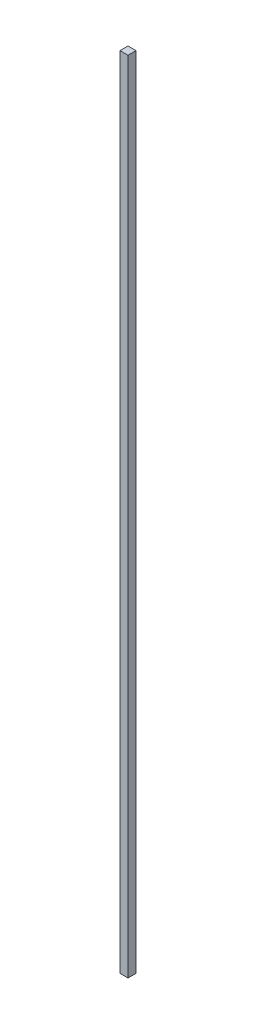
ISO-10303-21;
HEADER;
FILE_DESCRIPTION(('STEP AP214'),'2;1');
FILE_NAME('part.step','',(''),(''),'','','');
FILE_SCHEMA(('AUTOMOTIVE_DESIGN { 1 0 10303 214 1 1 1 1 }'));
ENDSEC;
DATA;
#1=APPLICATION_CONTEXT('core data for automotive mechanical design processes');
#2=APPLICATION_PROTOCOL_DEFINITION('international standard','automotive_design',2000,#1);
#3=PRODUCT_CONTEXT('',#1,'mechanical');
#4=PRODUCT('Part','Part','',(#3));
#5=PRODUCT_RELATED_PRODUCT_CATEGORY('part','',(#4));
#6=PRODUCT_DEFINITION_FORMATION('','',#4);
#7=PRODUCT_DEFINITION_CONTEXT('part definition',#1,'design');
#8=PRODUCT_DEFINITION('design','',#6,#7);
#9=PRODUCT_DEFINITION_SHAPE('','',#8);
#10=(LENGTH_UNIT() NAMED_UNIT(*) SI_UNIT(.MILLI.,.METRE.));
#11=(NAMED_UNIT(*) PLANE_ANGLE_UNIT() SI_UNIT($,.RADIAN.));
#12=(NAMED_UNIT(*) SI_UNIT($,.STERADIAN.) SOLID_ANGLE_UNIT());
#13=UNCERTAINTY_MEASURE_WITH_UNIT(LENGTH_MEASURE(1.E-05),#10,'distance_accuracy_value','');
#14=(GEOMETRIC_REPRESENTATION_CONTEXT(3) GLOBAL_UNCERTAINTY_ASSIGNED_CONTEXT((#13)) GLOBAL_UNIT_ASSIGNED_CONTEXT((#10,
#11,#12)) REPRESENTATION_CONTEXT('',''));
#15=CARTESIAN_POINT('',(0.,0.,0.));
#16=DIRECTION('',(0.,0.,1.));
#17=DIRECTION('',(1.,0.,0.));
#18=AXIS2_PLACEMENT_3D('',#15,#16,#17);
#19=CARTESIAN_POINT('',(0.,2000.,0.));
#20=DIRECTION('',(1.,0.,0.));
#21=DIRECTION('',(0.,0.,-1.));
#22=AXIS2_PLACEMENT_3D('',#19,#20,#21);
#23=PLANE('',#22);
#24=DIRECTION('',(0.,0.,1.));
#25=VECTOR('',#24,1.);
#26=CARTESIAN_POINT('',(0.,0.,0.));
#27=LINE('',#26,#25);
#28=CARTESIAN_POINT('',(0.,0.,0.));
#29=VERTEX_POINT('',#28);
#30=CARTESIAN_POINT('',(0.,0.,20.));
#31=VERTEX_POINT('',#30);
#32=EDGE_CURVE('E95',#29,#31,#27,.T.);
#33=ORIENTED_EDGE('',*,*,#32,.T.);
#34=DIRECTION('',(0.,-1.,0.));
#35=VECTOR('',#34,1.);
#36=CARTESIAN_POINT('',(0.,2000.,20.));
#37=LINE('',#36,#35);
#38=CARTESIAN_POINT('',(0.,2000.,20.));
#39=VERTEX_POINT('',#38);
#40=EDGE_CURVE('E11',#39,#31,#37,.T.);
#41=ORIENTED_EDGE('',*,*,#40,.F.);
#42=DIRECTION('',(0.,0.,1.));
#43=VECTOR('',#42,1.);
#44=CARTESIAN_POINT('',(0.,2000.,0.));
#45=LINE('',#44,#43);
#46=CARTESIAN_POINT('',(0.,2000.,0.));
#47=VERTEX_POINT('',#46);
#48=EDGE_CURVE('E83',#47,#39,#45,.T.);
#49=ORIENTED_EDGE('',*,*,#48,.F.);
#50=DIRECTION('',(0.,-1.,0.));
#51=VECTOR('',#50,1.);
#52=CARTESIAN_POINT('',(0.,2000.,0.));
#53=LINE('',#52,#51);
#54=EDGE_CURVE('E91',#47,#29,#53,.T.);
#55=ORIENTED_EDGE('',*,*,#54,.T.);
#56=EDGE_LOOP('',(#33,#41,#49,#55));
#57=FACE_BOUND('',#56,.T.);
#58=ADVANCED_FACE('F32',(#57),#23,.F.);
#59=CARTESIAN_POINT('',(0.,2000.,20.));
#60=DIRECTION('',(0.,0.,-1.));
#61=DIRECTION('',(-1.,0.,0.));
#62=AXIS2_PLACEMENT_3D('',#59,#60,#61);
#63=PLANE('',#62);
#64=DIRECTION('',(1.,0.,0.));
#65=VECTOR('',#64,1.);
#66=CARTESIAN_POINT('',(0.,0.,20.));
#67=LINE('',#66,#65);
#68=CARTESIAN_POINT('',(20.,0.,20.));
#69=VERTEX_POINT('',#68);
#70=EDGE_CURVE('E87',#31,#69,#67,.T.);
#71=ORIENTED_EDGE('',*,*,#70,.T.);
#72=DIRECTION('',(0.,-1.,0.));
#73=VECTOR('',#72,1.);
#74=CARTESIAN_POINT('',(20.,2000.,20.));
#75=LINE('',#74,#73);
#76=CARTESIAN_POINT('',(20.,2000.,20.));
#77=VERTEX_POINT('',#76);
#78=EDGE_CURVE('E40',#77,#69,#75,.T.);
#79=ORIENTED_EDGE('',*,*,#78,.F.);
#80=DIRECTION('',(1.,0.,0.));
#81=VECTOR('',#80,1.);
#82=CARTESIAN_POINT('',(0.,2000.,20.));
#83=LINE('',#82,#81);
#84=EDGE_CURVE('E78',#39,#77,#83,.T.);
#85=ORIENTED_EDGE('',*,*,#84,.F.);
#86=ORIENTED_EDGE('',*,*,#40,.T.);
#87=EDGE_LOOP('',(#71,#79,#85,#86));
#88=FACE_BOUND('',#87,.T.);
#89=ADVANCED_FACE('F86',(#88),#63,.F.);
#90=CARTESIAN_POINT('',(20.,2000.,0.));
#91=DIRECTION('',(-1.,0.,0.));
#92=DIRECTION('',(0.,0.,1.));
#93=AXIS2_PLACEMENT_3D('',#90,#91,#92);
#94=PLANE('',#93);
#95=DIRECTION('',(0.,0.,-1.));
#96=VECTOR('',#95,1.);
#97=CARTESIAN_POINT('',(20.,0.,0.));
#98=LINE('',#97,#96);
#99=CARTESIAN_POINT('',(20.,0.,0.));
#100=VERTEX_POINT('',#99);
#101=EDGE_CURVE('E65',#69,#100,#98,.T.);
#102=ORIENTED_EDGE('',*,*,#101,.T.);
#103=DIRECTION('',(0.,-1.,0.));
#104=VECTOR('',#103,1.);
#105=CARTESIAN_POINT('',(20.,2000.,0.));
#106=LINE('',#105,#104);
#107=CARTESIAN_POINT('',(20.,2000.,0.));
#108=VERTEX_POINT('',#107);
#109=EDGE_CURVE('E88',#108,#100,#106,.T.);
#110=ORIENTED_EDGE('',*,*,#109,.F.);
#111=DIRECTION('',(0.,0.,-1.));
#112=VECTOR('',#111,1.);
#113=CARTESIAN_POINT('',(20.,2000.,0.));
#114=LINE('',#113,#112);
#115=EDGE_CURVE('E81',#77,#108,#114,.T.);
#116=ORIENTED_EDGE('',*,*,#115,.F.);
#117=ORIENTED_EDGE('',*,*,#78,.T.);
#118=EDGE_LOOP('',(#102,#110,#116,#117));
#119=FACE_BOUND('',#118,.T.);
#120=ADVANCED_FACE('F89',(#119),#94,.F.);
#121=CARTESIAN_POINT('',(0.,2000.,0.));
#122=DIRECTION('',(0.,0.,1.));
#123=DIRECTION('',(1.,0.,0.));
#124=AXIS2_PLACEMENT_3D('',#121,#122,#123);
#125=PLANE('',#124);
#126=DIRECTION('',(-1.,0.,0.));
#127=VECTOR('',#126,1.);
#128=CARTESIAN_POINT('',(0.,0.,0.));
#129=LINE('',#128,#127);
#130=EDGE_CURVE('E71',#100,#29,#129,.T.);
#131=ORIENTED_EDGE('',*,*,#130,.T.);
#132=ORIENTED_EDGE('',*,*,#54,.F.);
#133=DIRECTION('',(-1.,0.,0.));
#134=VECTOR('',#133,1.);
#135=CARTESIAN_POINT('',(0.,2000.,0.));
#136=LINE('',#135,#134);
#137=EDGE_CURVE('E48',#108,#47,#136,.T.);
#138=ORIENTED_EDGE('',*,*,#137,.F.);
#139=ORIENTED_EDGE('',*,*,#109,.T.);
#140=EDGE_LOOP('',(#131,#132,#138,#139));
#141=FACE_BOUND('',#140,.T.);
#142=ADVANCED_FACE('F102',(#141),#125,.F.);
#143=CARTESIAN_POINT('',(0.,2000.,0.));
#144=DIRECTION('',(0.,1.,0.));
#145=DIRECTION('',(0.,0.,1.));
#146=AXIS2_PLACEMENT_3D('',#143,#144,#145);
#147=PLANE('',#146);
#148=ORIENTED_EDGE('',*,*,#48,.T.);
#149=ORIENTED_EDGE('',*,*,#84,.T.);
#150=ORIENTED_EDGE('',*,*,#115,.T.);
#151=ORIENTED_EDGE('',*,*,#137,.T.);
#152=EDGE_LOOP('',(#148,#149,#150,#151));
#153=FACE_BOUND('',#152,.T.);
#154=ADVANCED_FACE('F79',(#153),#147,.T.);
#155=CARTESIAN_POINT('',(0.,0.,0.));
#156=DIRECTION('',(0.,1.,0.));
#157=DIRECTION('',(0.,0.,1.));
#158=AXIS2_PLACEMENT_3D('',#155,#156,#157);
#159=PLANE('',#158);
#160=ORIENTED_EDGE('',*,*,#32,.F.);
#161=ORIENTED_EDGE('',*,*,#130,.F.);
#162=ORIENTED_EDGE('',*,*,#101,.F.);
#163=ORIENTED_EDGE('',*,*,#70,.F.);
#164=EDGE_LOOP('',(#160,#161,#162,#163));
#165=FACE_BOUND('',#164,.T.);
#166=ADVANCED_FACE('F105',(#165),#159,.F.);
#167=CLOSED_SHELL('',(#58,#89,#120,#142,#154,#166));
#168=MANIFOLD_SOLID_BREP('B2',#167);
#169=ADVANCED_BREP_SHAPE_REPRESENTATION('',(#18,#168),#14);
#170=SHAPE_DEFINITION_REPRESENTATION(#9,#169);
ENDSEC;
END-ISO-10303-21;
